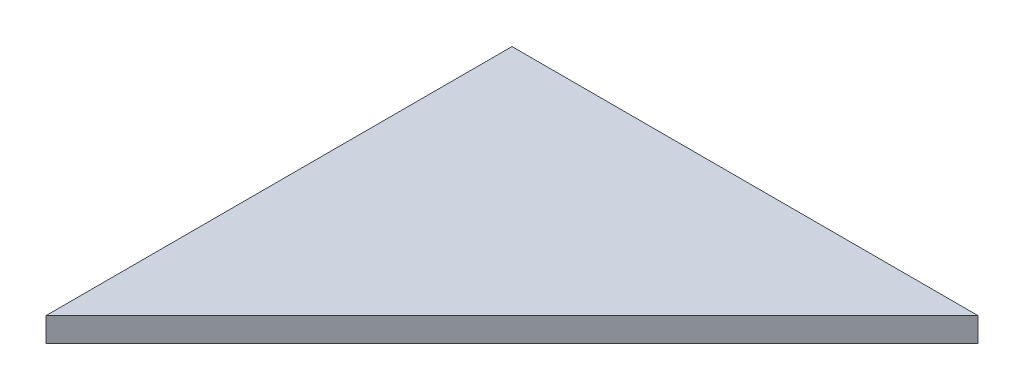
ISO-10303-21;
HEADER;
FILE_DESCRIPTION(('STEP AP214'),'2;1');
FILE_NAME('part.step','',(''),(''),'','','');
FILE_SCHEMA(('AUTOMOTIVE_DESIGN { 1 0 10303 214 1 1 1 1 }'));
ENDSEC;
DATA;
#1=APPLICATION_CONTEXT('core data for automotive mechanical design processes');
#2=APPLICATION_PROTOCOL_DEFINITION('international standard','automotive_design',2000,#1);
#3=PRODUCT_CONTEXT('',#1,'mechanical');
#4=PRODUCT('Part','Part','',(#3));
#5=PRODUCT_RELATED_PRODUCT_CATEGORY('part','',(#4));
#6=PRODUCT_DEFINITION_FORMATION('','',#4);
#7=PRODUCT_DEFINITION_CONTEXT('part definition',#1,'design');
#8=PRODUCT_DEFINITION('design','',#6,#7);
#9=PRODUCT_DEFINITION_SHAPE('','',#8);
#10=(LENGTH_UNIT() NAMED_UNIT(*) SI_UNIT(.MILLI.,.METRE.));
#11=(NAMED_UNIT(*) PLANE_ANGLE_UNIT() SI_UNIT($,.RADIAN.));
#12=(NAMED_UNIT(*) SI_UNIT($,.STERADIAN.) SOLID_ANGLE_UNIT());
#13=UNCERTAINTY_MEASURE_WITH_UNIT(LENGTH_MEASURE(1.E-05),#10,'distance_accuracy_value','');
#14=(GEOMETRIC_REPRESENTATION_CONTEXT(3) GLOBAL_UNCERTAINTY_ASSIGNED_CONTEXT((#13)) GLOBAL_UNIT_ASSIGNED_CONTEXT((#10,
#11,#12)) REPRESENTATION_CONTEXT('',''));
#15=CARTESIAN_POINT('',(0.,0.,0.));
#16=DIRECTION('',(0.,0.,1.));
#17=DIRECTION('',(1.,0.,0.));
#18=AXIS2_PLACEMENT_3D('',#15,#16,#17);
#19=CARTESIAN_POINT('',(49.6381025755781,-112.204878,49.6381025755782));
#20=DIRECTION('',(0.,0.,-1.));
#21=DIRECTION('',(-1.,0.,0.));
#22=AXIS2_PLACEMENT_3D('',#19,#20,#21);
#23=PLANE('',#22);
#24=DIRECTION('',(1.,0.,0.));
#25=VECTOR('',#24,1.);
#26=CARTESIAN_POINT('',(49.6381025755781,-115.204878,49.6381025755782));
#27=LINE('',#26,#25);
#28=CARTESIAN_POINT('',(49.6381025755781,-115.204878,49.6381025755782));
#29=VERTEX_POINT('',#28);
#30=CARTESIAN_POINT('',(107.572775551572,-115.204878,49.6381025755781));
#31=VERTEX_POINT('',#30);
#32=EDGE_CURVE('E92',#29,#31,#27,.T.);
#33=ORIENTED_EDGE('',*,*,#32,.F.);
#34=DIRECTION('',(0.,-1.,0.));
#35=VECTOR('',#34,1.);
#36=CARTESIAN_POINT('',(49.6381025755781,-112.204878,49.6381025755782));
#37=LINE('',#36,#35);
#38=CARTESIAN_POINT('',(49.6381025755781,-112.204878,49.6381025755782));
#39=VERTEX_POINT('',#38);
#40=EDGE_CURVE('E11',#39,#29,#37,.T.);
#41=ORIENTED_EDGE('',*,*,#40,.F.);
#42=DIRECTION('',(1.,0.,0.));
#43=VECTOR('',#42,1.);
#44=CARTESIAN_POINT('',(49.6381025755781,-112.204878,49.6381025755782));
#45=LINE('',#44,#43);
#46=CARTESIAN_POINT('',(107.572775551572,-112.204878,49.6381025755781));
#47=VERTEX_POINT('',#46);
#48=EDGE_CURVE('E81',#39,#47,#45,.T.);
#49=ORIENTED_EDGE('',*,*,#48,.T.);
#50=DIRECTION('',(0.,-1.,0.));
#51=VECTOR('',#50,1.);
#52=CARTESIAN_POINT('',(107.572775551572,-112.204878,49.6381025755781));
#53=LINE('',#52,#51);
#54=EDGE_CURVE('E40',#47,#31,#53,.T.);
#55=ORIENTED_EDGE('',*,*,#54,.T.);
#56=EDGE_LOOP('',(#33,#41,#49,#55));
#57=FACE_BOUND('',#56,.T.);
#58=ADVANCED_FACE('F37',(#57),#23,.T.);
#59=CARTESIAN_POINT('',(49.6381025755781,-112.204878,107.572775551572));
#60=DIRECTION('',(-1.,0.,0.));
#61=DIRECTION('',(0.,0.,1.));
#62=AXIS2_PLACEMENT_3D('',#59,#60,#61);
#63=PLANE('',#62);
#64=DIRECTION('',(0.,0.,-1.));
#65=VECTOR('',#64,1.);
#66=CARTESIAN_POINT('',(49.6381025755781,-115.204878,107.572775551572));
#67=LINE('',#66,#65);
#68=CARTESIAN_POINT('',(49.6381025755781,-115.204878,107.572775551572));
#69=VERTEX_POINT('',#68);
#70=EDGE_CURVE('E84',#69,#29,#67,.T.);
#71=ORIENTED_EDGE('',*,*,#70,.F.);
#72=DIRECTION('',(0.,-1.,0.));
#73=VECTOR('',#72,1.);
#74=CARTESIAN_POINT('',(49.6381025755781,-112.204878,107.572775551572));
#75=LINE('',#74,#73);
#76=CARTESIAN_POINT('',(49.6381025755781,-112.204878,107.572775551572));
#77=VERTEX_POINT('',#76);
#78=EDGE_CURVE('E46',#77,#69,#75,.T.);
#79=ORIENTED_EDGE('',*,*,#78,.F.);
#80=DIRECTION('',(0.,0.,-1.));
#81=VECTOR('',#80,1.);
#82=CARTESIAN_POINT('',(49.6381025755781,-112.204878,107.572775551572));
#83=LINE('',#82,#81);
#84=EDGE_CURVE('E78',#77,#39,#83,.T.);
#85=ORIENTED_EDGE('',*,*,#84,.T.);
#86=ORIENTED_EDGE('',*,*,#40,.T.);
#87=EDGE_LOOP('',(#71,#79,#85,#86));
#88=FACE_BOUND('',#87,.T.);
#89=ADVANCED_FACE('F97',(#88),#63,.T.);
#90=CARTESIAN_POINT('',(107.572775551572,-112.204878,49.6381025755781));
#91=DIRECTION('',(0.707106781186547,0.,0.707106781186547));
#92=DIRECTION('',(0.707106781186548,0.,-0.707106781186548));
#93=AXIS2_PLACEMENT_3D('',#90,#91,#92);
#94=PLANE('',#93);
#95=DIRECTION('',(-0.707106781186548,0.,0.707106781186548));
#96=VECTOR('',#95,1.);
#97=CARTESIAN_POINT('',(107.572775551572,-115.204878,49.6381025755781));
#98=LINE('',#97,#96);
#99=EDGE_CURVE('E76',#31,#69,#98,.T.);
#100=ORIENTED_EDGE('',*,*,#99,.F.);
#101=ORIENTED_EDGE('',*,*,#54,.F.);
#102=DIRECTION('',(-0.707106781186548,0.,0.707106781186548));
#103=VECTOR('',#102,1.);
#104=CARTESIAN_POINT('',(107.572775551572,-112.204878,49.6381025755781));
#105=LINE('',#104,#103);
#106=EDGE_CURVE('E74',#47,#77,#105,.T.);
#107=ORIENTED_EDGE('',*,*,#106,.T.);
#108=ORIENTED_EDGE('',*,*,#78,.T.);
#109=EDGE_LOOP('',(#100,#101,#107,#108));
#110=FACE_BOUND('',#109,.T.);
#111=ADVANCED_FACE('F73',(#110),#94,.T.);
#112=CARTESIAN_POINT('',(0.,-112.204878,0.));
#113=DIRECTION('',(0.,1.,0.));
#114=DIRECTION('',(0.,0.,1.));
#115=AXIS2_PLACEMENT_3D('',#112,#113,#114);
#116=PLANE('',#115);
#117=ORIENTED_EDGE('',*,*,#48,.F.);
#118=ORIENTED_EDGE('',*,*,#84,.F.);
#119=ORIENTED_EDGE('',*,*,#106,.F.);
#120=EDGE_LOOP('',(#117,#118,#119));
#121=FACE_BOUND('',#120,.T.);
#122=ADVANCED_FACE('F80',(#121),#116,.T.);
#123=CARTESIAN_POINT('',(0.,-115.204878,0.));
#124=DIRECTION('',(0.,1.,0.));
#125=DIRECTION('',(0.,0.,1.));
#126=AXIS2_PLACEMENT_3D('',#123,#124,#125);
#127=PLANE('',#126);
#128=ORIENTED_EDGE('',*,*,#32,.T.);
#129=ORIENTED_EDGE('',*,*,#99,.T.);
#130=ORIENTED_EDGE('',*,*,#70,.T.);
#131=EDGE_LOOP('',(#128,#129,#130));
#132=FACE_BOUND('',#131,.T.);
#133=ADVANCED_FACE('F96',(#132),#127,.F.);
#134=CLOSED_SHELL('',(#58,#89,#111,#122,#133));
#135=MANIFOLD_SOLID_BREP('B2',#134);
#136=ADVANCED_BREP_SHAPE_REPRESENTATION('',(#18,#135),#14);
#137=SHAPE_DEFINITION_REPRESENTATION(#9,#136);
ENDSEC;
END-ISO-10303-21;
